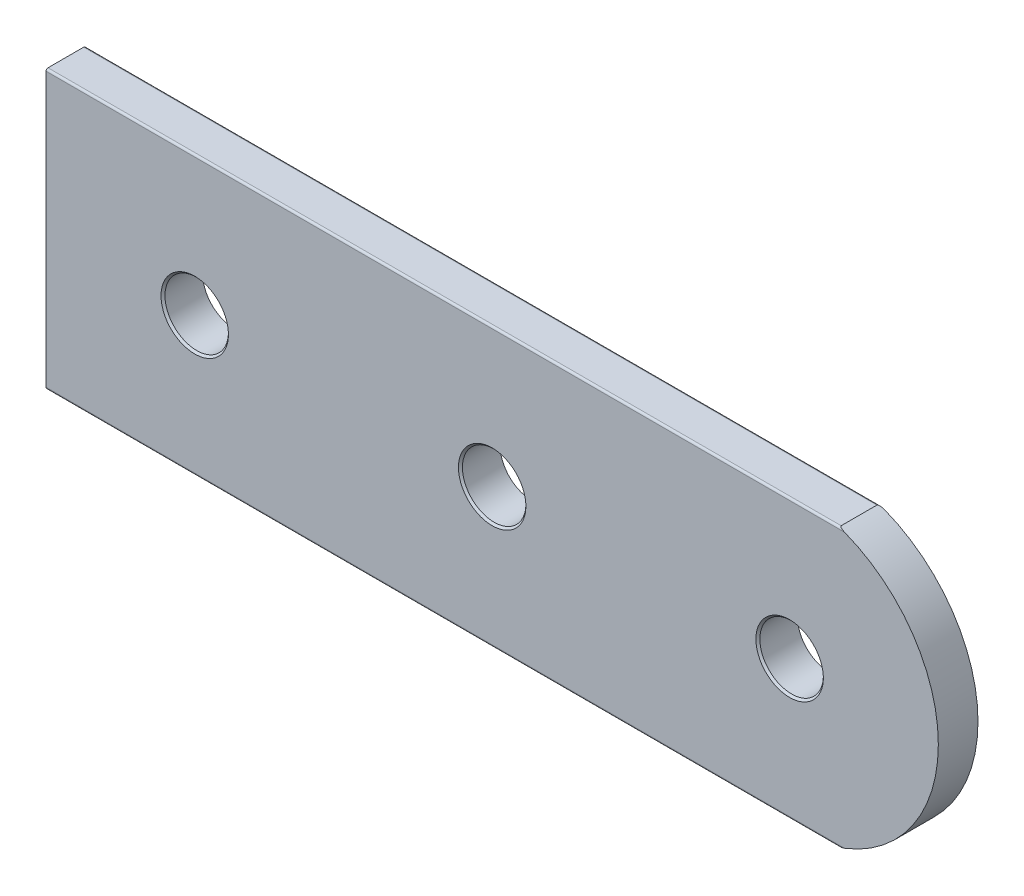
ISO-10303-21;
HEADER;
FILE_DESCRIPTION(('STEP AP214'),'2;1');
FILE_NAME('part.step','',(''),(''),'','','');
FILE_SCHEMA(('AUTOMOTIVE_DESIGN { 1 0 10303 214 1 1 1 1 }'));
ENDSEC;
DATA;
#1=APPLICATION_CONTEXT('core data for automotive mechanical design processes');
#2=APPLICATION_PROTOCOL_DEFINITION('international standard','automotive_design',2000,#1);
#3=PRODUCT_CONTEXT('',#1,'mechanical');
#4=PRODUCT('Part','Part','',(#3));
#5=PRODUCT_RELATED_PRODUCT_CATEGORY('part','',(#4));
#6=PRODUCT_DEFINITION_FORMATION('','',#4);
#7=PRODUCT_DEFINITION_CONTEXT('part definition',#1,'design');
#8=PRODUCT_DEFINITION('design','',#6,#7);
#9=PRODUCT_DEFINITION_SHAPE('','',#8);
#10=(LENGTH_UNIT() NAMED_UNIT(*) SI_UNIT(.MILLI.,.METRE.));
#11=(NAMED_UNIT(*) PLANE_ANGLE_UNIT() SI_UNIT($,.RADIAN.));
#12=(NAMED_UNIT(*) SI_UNIT($,.STERADIAN.) SOLID_ANGLE_UNIT());
#13=UNCERTAINTY_MEASURE_WITH_UNIT(LENGTH_MEASURE(1.E-05),#10,'distance_accuracy_value','');
#14=(GEOMETRIC_REPRESENTATION_CONTEXT(3) GLOBAL_UNCERTAINTY_ASSIGNED_CONTEXT((#13)) GLOBAL_UNIT_ASSIGNED_CONTEXT((#10,
#11,#12)) REPRESENTATION_CONTEXT('',''));
#15=CARTESIAN_POINT('',(0.,0.,0.));
#16=DIRECTION('',(0.,0.,1.));
#17=DIRECTION('',(1.,0.,0.));
#18=AXIS2_PLACEMENT_3D('',#15,#16,#17);
#19=CARTESIAN_POINT('',(35.2,0.,4.));
#20=DIRECTION('',(0.,0.,-1.));
#21=DIRECTION('',(-1.,0.,0.));
#22=AXIS2_PLACEMENT_3D('',#19,#20,#21);
#23=PLANE('',#22);
#24=CARTESIAN_POINT('',(35.,0.,4.));
#25=DIRECTION('',(0.,0.,-1.));
#26=DIRECTION('',(-1.,0.,0.));
#27=AXIS2_PLACEMENT_3D('',#24,#25,#26);
#28=CIRCLE('',#27,3.39999999999997);
#29=CARTESIAN_POINT('',(31.6,0.,4.));
#30=VERTEX_POINT('',#29);
#31=EDGE_CURVE('E236',#30,#30,#28,.T.);
#32=ORIENTED_EDGE('',*,*,#31,.T.);
#33=EDGE_LOOP('',(#32));
#34=FACE_BOUND('',#33,.T.);
#35=CARTESIAN_POINT('',(5.00000000000002,0.,4.));
#36=DIRECTION('',(0.,0.,-1.));
#37=DIRECTION('',(-1.,0.,0.));
#38=AXIS2_PLACEMENT_3D('',#35,#36,#37);
#39=CIRCLE('',#38,3.39999999999997);
#40=CARTESIAN_POINT('',(1.60000000000005,0.,4.));
#41=VERTEX_POINT('',#40);
#42=EDGE_CURVE('E233',#41,#41,#39,.T.);
#43=ORIENTED_EDGE('',*,*,#42,.T.);
#44=EDGE_LOOP('',(#43));
#45=FACE_BOUND('',#44,.T.);
#46=CARTESIAN_POINT('',(-25.,0.,4.));
#47=DIRECTION('',(0.,0.,-1.));
#48=DIRECTION('',(-1.,0.,0.));
#49=AXIS2_PLACEMENT_3D('',#46,#47,#48);
#50=CIRCLE('',#49,3.39999999999997);
#51=CARTESIAN_POINT('',(-28.4,0.,4.));
#52=VERTEX_POINT('',#51);
#53=EDGE_CURVE('E230',#52,#52,#50,.T.);
#54=ORIENTED_EDGE('',*,*,#53,.T.);
#55=EDGE_LOOP('',(#54));
#56=FACE_BOUND('',#55,.T.);
#57=DIRECTION('',(0.,-1.,0.));
#58=VECTOR('',#57,1.);
#59=CARTESIAN_POINT('',(-40.,14.,4.));
#60=LINE('',#59,#58);
#61=CARTESIAN_POINT('',(-40.,13.8,4.));
#62=VERTEX_POINT('',#61);
#63=CARTESIAN_POINT('',(-40.,-13.8,4.));
#64=VERTEX_POINT('',#63);
#65=EDGE_CURVE('E105',#62,#64,#60,.T.);
#66=ORIENTED_EDGE('',*,*,#65,.T.);
#67=DIRECTION('',(1.,0.,0.));
#68=VECTOR('',#67,1.);
#69=CARTESIAN_POINT('',(35.2,-13.8,4.));
#70=LINE('',#69,#68);
#71=CARTESIAN_POINT('',(40.5478967828484,-13.8,4.));
#72=VERTEX_POINT('',#71);
#73=EDGE_CURVE('E203',#64,#72,#70,.T.);
#74=ORIENTED_EDGE('',*,*,#73,.T.);
#75=CARTESIAN_POINT('',(35.2,0.,4.));
#76=DIRECTION('',(0.,0.,1.));
#77=DIRECTION('',(-1.,0.,0.));
#78=AXIS2_PLACEMENT_3D('',#75,#76,#77);
#79=CIRCLE('',#78,14.8);
#80=CARTESIAN_POINT('',(40.5478967828484,13.8,4.));
#81=VERTEX_POINT('',#80);
#82=EDGE_CURVE('E88',#72,#81,#79,.T.);
#83=ORIENTED_EDGE('',*,*,#82,.T.);
#84=DIRECTION('',(-1.,0.,0.));
#85=VECTOR('',#84,1.);
#86=CARTESIAN_POINT('',(35.2,13.8,4.));
#87=LINE('',#86,#85);
#88=EDGE_CURVE('E200',#81,#62,#87,.T.);
#89=ORIENTED_EDGE('',*,*,#88,.T.);
#90=EDGE_LOOP('',(#66,#74,#83,#89));
#91=FACE_BOUND('',#90,.T.);
#92=ADVANCED_FACE('F16',(#34,#45,#56,#91),#23,.F.);
#93=CARTESIAN_POINT('',(35.2,0.,0.));
#94=DIRECTION('',(0.,0.,-1.));
#95=DIRECTION('',(-1.,0.,0.));
#96=AXIS2_PLACEMENT_3D('',#93,#94,#95);
#97=PLANE('',#96);
#98=CARTESIAN_POINT('',(5.00000000000002,0.,0.));
#99=DIRECTION('',(0.,0.,1.));
#100=DIRECTION('',(1.,0.,0.));
#101=AXIS2_PLACEMENT_3D('',#98,#99,#100);
#102=CIRCLE('',#101,3.2);
#103=CARTESIAN_POINT('',(8.20000000000002,0.,0.));
#104=VERTEX_POINT('',#103);
#105=EDGE_CURVE('E276',#104,#104,#102,.T.);
#106=ORIENTED_EDGE('',*,*,#105,.T.);
#107=EDGE_LOOP('',(#106));
#108=FACE_BOUND('',#107,.T.);
#109=CARTESIAN_POINT('',(35.2,0.,0.));
#110=DIRECTION('',(0.,0.,1.));
#111=DIRECTION('',(-1.,0.,0.));
#112=AXIS2_PLACEMENT_3D('',#109,#110,#111);
#113=CIRCLE('',#112,14.8);
#114=CARTESIAN_POINT('',(40.5478967828484,-13.8,0.));
#115=VERTEX_POINT('',#114);
#116=CARTESIAN_POINT('',(40.5478967828484,13.8,0.));
#117=VERTEX_POINT('',#116);
#118=EDGE_CURVE('E195',#115,#117,#113,.T.);
#119=ORIENTED_EDGE('',*,*,#118,.F.);
#120=DIRECTION('',(1.,0.,0.));
#121=VECTOR('',#120,1.);
#122=CARTESIAN_POINT('',(-40.,-13.8,0.));
#123=LINE('',#122,#121);
#124=CARTESIAN_POINT('',(-40.,-13.8,0.));
#125=VERTEX_POINT('',#124);
#126=EDGE_CURVE('E199',#115,#125,#123,.F.);
#127=ORIENTED_EDGE('',*,*,#126,.T.);
#128=DIRECTION('',(0.,-1.,0.));
#129=VECTOR('',#128,1.);
#130=CARTESIAN_POINT('',(-40.,14.,0.));
#131=LINE('',#130,#129);
#132=CARTESIAN_POINT('',(-40.,13.8,0.));
#133=VERTEX_POINT('',#132);
#134=EDGE_CURVE('E191',#133,#125,#131,.T.);
#135=ORIENTED_EDGE('',*,*,#134,.F.);
#136=DIRECTION('',(-1.,0.,0.));
#137=VECTOR('',#136,1.);
#138=CARTESIAN_POINT('',(40.,13.8,0.));
#139=LINE('',#138,#137);
#140=EDGE_CURVE('E389',#133,#117,#139,.F.);
#141=ORIENTED_EDGE('',*,*,#140,.T.);
#142=EDGE_LOOP('',(#119,#127,#135,#141));
#143=FACE_BOUND('',#142,.T.);
#144=CARTESIAN_POINT('',(-25.,0.,0.));
#145=DIRECTION('',(0.,0.,1.));
#146=DIRECTION('',(1.,0.,0.));
#147=AXIS2_PLACEMENT_3D('',#144,#145,#146);
#148=CIRCLE('',#147,3.2);
#149=CARTESIAN_POINT('',(-21.8,0.,0.));
#150=VERTEX_POINT('',#149);
#151=EDGE_CURVE('E224',#150,#150,#148,.T.);
#152=ORIENTED_EDGE('',*,*,#151,.T.);
#153=EDGE_LOOP('',(#152));
#154=FACE_BOUND('',#153,.T.);
#155=CARTESIAN_POINT('',(35.,0.,0.));
#156=DIRECTION('',(0.,0.,1.));
#157=DIRECTION('',(1.,0.,0.));
#158=AXIS2_PLACEMENT_3D('',#155,#156,#157);
#159=CIRCLE('',#158,3.2);
#160=CARTESIAN_POINT('',(38.2,0.,0.));
#161=VERTEX_POINT('',#160);
#162=EDGE_CURVE('E278',#161,#161,#159,.T.);
#163=ORIENTED_EDGE('',*,*,#162,.T.);
#164=EDGE_LOOP('',(#163));
#165=FACE_BOUND('',#164,.T.);
#166=ADVANCED_FACE('F134',(#108,#143,#154,#165),#97,.T.);
#167=CARTESIAN_POINT('',(35.2,0.,4.));
#168=DIRECTION('',(0.,0.,-1.));
#169=DIRECTION('',(-1.,0.,0.));
#170=AXIS2_PLACEMENT_3D('',#167,#168,#169);
#171=CYLINDRICAL_SURFACE('',#170,14.8);
#172=DIRECTION('',(0.,0.,-1.));
#173=VECTOR('',#172,1.);
#174=CARTESIAN_POINT('',(40.,-14.,4.));
#175=LINE('',#174,#173);
#176=CARTESIAN_POINT('',(40.,-14.,3.8));
#177=VERTEX_POINT('',#176);
#178=CARTESIAN_POINT('',(40.,-14.,0.2));
#179=VERTEX_POINT('',#178);
#180=EDGE_CURVE('E86',#177,#179,#175,.T.);
#181=ORIENTED_EDGE('',*,*,#180,.T.);
#182=CARTESIAN_POINT('',(40.,-14.,0.2));
#183=CARTESIAN_POINT('',(39.999987042076,-14.0000043871712,0.195760955519449));
#184=CARTESIAN_POINT('',(40.0003924547076,-13.9998654476036,0.191541560953724));
#185=CARTESIAN_POINT('',(40.0019157839262,-13.9993430498048,0.183307048887309));
#186=CARTESIAN_POINT('',(40.003023711759,-13.9989630194992,0.179289906369511));
#187=CARTESIAN_POINT('',(40.0061923361807,-13.9978754982801,0.170507511967823));
#188=CARTESIAN_POINT('',(40.0084239940115,-13.9971091997623,0.165812868750464));
#189=CARTESIAN_POINT('',(40.0135669859811,-13.995341382195,0.156840239871947));
#190=CARTESIAN_POINT('',(40.0164822022964,-13.994338519408,0.152564839655963));
#191=CARTESIAN_POINT('',(40.0251031983457,-13.9913691997737,0.141418611532193));
#192=CARTESIAN_POINT('',(40.0312802539167,-13.9892379520293,0.134961923501008));
#193=CARTESIAN_POINT('',(40.0443997520876,-13.984700212358,0.123016076352729));
#194=CARTESIAN_POINT('',(40.0513439063475,-13.9822931044258,0.117529154992094));
#195=CARTESIAN_POINT('',(40.0688416352545,-13.9762119296496,0.105043193371178));
#196=CARTESIAN_POINT('',(40.0796412237347,-13.9724456488635,0.0984380932553144));
#197=CARTESIAN_POINT('',(40.1017669496461,-13.9646990540494,0.0863098527561242));
#198=CARTESIAN_POINT('',(40.1130941551654,-13.9607183030571,0.0807890366032843));
#199=CARTESIAN_POINT('',(40.1477449128963,-13.9484917086814,0.0653704033831685));
#200=CARTESIAN_POINT('',(40.1715482278738,-13.9400272196656,0.0567343469871422));
#201=CARTESIAN_POINT('',(40.2250540222698,-13.9208409895013,0.0400272394068397));
#202=CARTESIAN_POINT('',(40.2548896714128,-13.910036370565,0.0325103618960423));
#203=CARTESIAN_POINT('',(40.3149985693746,-13.8880458146632,0.0199792859557485));
#204=CARTESIAN_POINT('',(40.3452725555086,-13.8768591779079,0.014969976216418));
#205=CARTESIAN_POINT('',(40.404323771512,-13.8548169174474,0.00732406290818679));
#206=CARTESIAN_POINT('',(40.4330922660666,-13.8439766712403,0.00457263510048292));
#207=CARTESIAN_POINT('',(40.4905521292495,-13.8221200651228,0.000926105912625353));
#208=CARTESIAN_POINT('',(40.5192433617528,-13.81110455578,2.38148476812331E-05));
#209=CARTESIAN_POINT('',(40.5478967828484,-13.8,0.));
#210=B_SPLINE_CURVE_WITH_KNOTS('',3,(#182,#183,#184,#185,#186,#187,#188,#189,#190,#191,#192,
#193,#194,#195,#196,#197,#198,#199,#200,#201,#202,#203,#204,#205,#206,#207,#208,#209),
.UNSPECIFIED.,.F.,.F.,(4,2,2,2,2,2,2,2,2,2,2,2,2,4),(0.,0.0126639868598921,0.0251518284803406,
0.0408256232179408,0.0565906886375604,0.0839945909873167,0.11146092547406,0.150987600963404,
0.19059810113327,0.270510111264701,0.368219237782434,0.466118120769147,0.558660565763093,
0.650842505716824),.UNSPECIFIED.);
#211=EDGE_CURVE('E93',#179,#115,#210,.T.);
#212=ORIENTED_EDGE('',*,*,#211,.T.);
#213=ORIENTED_EDGE('',*,*,#118,.T.);
#214=CARTESIAN_POINT('',(40.5478967828484,13.8,0.));
#215=CARTESIAN_POINT('',(40.5165311801748,13.8121559696248,3.60995158997288E-05));
#216=CARTESIAN_POINT('',(40.4851138393947,13.8242072440809,0.00111113933739787));
#217=CARTESIAN_POINT('',(40.4221646198644,13.8481092353699,0.00548019975328445));
#218=CARTESIAN_POINT('',(40.3906330337099,13.8599585251929,0.00878612195310392));
#219=CARTESIAN_POINT('',(40.3277160350305,13.883359093863,0.017770366566271));
#220=CARTESIAN_POINT('',(40.2963310952751,13.8949096614879,0.0234538804574722));
#221=CARTESIAN_POINT('',(40.2340932349799,13.9175785933099,0.0376527320327874));
#222=CARTESIAN_POINT('',(40.2032391884111,13.9286979579835,0.046161014488099));
#223=CARTESIAN_POINT('',(40.1615972136583,13.9435540758245,0.0606320321169265));
#224=CARTESIAN_POINT('',(40.1503067883027,13.9475662265758,0.0648681074503328));
#225=CARTESIAN_POINT('',(40.1279390036785,13.9554848623507,0.0740571155682161));
#226=CARTESIAN_POINT('',(40.1168622849338,13.9593910407608,0.0790119096506931));
#227=CARTESIAN_POINT('',(40.0937859736942,13.9674989167505,0.0904590800527942));
#228=CARTESIAN_POINT('',(40.0818347904806,13.9716799573605,0.0970645465211912));
#229=CARTESIAN_POINT('',(40.0588079055135,13.9797042641025,0.111809526536523));
#230=CARTESIAN_POINT('',(40.0477281825416,13.9835490921079,0.119941326041668));
#231=CARTESIAN_POINT('',(40.0335740551193,13.9884445324383,0.132891394582925));
#232=CARTESIAN_POINT('',(40.0297146590694,13.9897773890004,0.136734561549714));
#233=CARTESIAN_POINT('',(40.0224101871849,13.9922969792871,0.144862828623583));
#234=CARTESIAN_POINT('',(40.0189659358881,13.9934834223209,0.149148777813661));
#235=CARTESIAN_POINT('',(40.0126431112382,13.9956592434839,0.158287771951593));
#236=CARTESIAN_POINT('',(40.0097749679003,13.9966449918745,0.163149106174707));
#237=CARTESIAN_POINT('',(40.0050018875548,13.9982842993935,0.173361829232966));
#238=CARTESIAN_POINT('',(40.0030905257107,13.9989400744688,0.178709656300648));
#239=CARTESIAN_POINT('',(40.0012243613107,13.9995801732649,0.186791460763203));
#240=CARTESIAN_POINT('',(40.0007696924647,13.9997360878911,0.189400014934447));
#241=CARTESIAN_POINT('',(40.000155673969,13.9999466265476,0.194671122637961));
#242=CARTESIAN_POINT('',(39.9999980944716,14.0000006434399,0.197333904880659));
#243=CARTESIAN_POINT('',(39.9999999999996,14.0000000000002,0.199999999999877));
#244=B_SPLINE_CURVE_WITH_KNOTS('',3,(#214,#215,#216,#217,#218,#219,#220,#221,#222,#223,#224,
#225,#226,#227,#228,#229,#230,#231,#232,#233,#234,#235,#236,#237,#238,#239,#240,#241,#242,#243),
.UNSPECIFIED.,.F.,.F.,(4,2,2,2,2,2,2,2,2,2,2,2,2,2,4),(0.,0.100918319315302,0.202379332552382,
0.304063052171365,0.405494690385964,0.44360584994196,0.481817530662832,0.524606883458227,
0.567185535076796,0.583982284780748,0.600811863961887,0.617923056422423,0.634917751013695,
0.642857873811067,0.650845158661821),.UNSPECIFIED.);
#245=CARTESIAN_POINT('',(40.,14.,0.2));
#246=VERTEX_POINT('',#245);
#247=EDGE_CURVE('E94',#117,#246,#244,.T.);
#248=ORIENTED_EDGE('',*,*,#247,.T.);
#249=DIRECTION('',(0.,0.,-1.));
#250=VECTOR('',#249,1.);
#251=CARTESIAN_POINT('',(40.,14.,4.));
#252=LINE('',#251,#250);
#253=CARTESIAN_POINT('',(40.,14.,3.8));
#254=VERTEX_POINT('',#253);
#255=EDGE_CURVE('E211',#254,#246,#252,.T.);
#256=ORIENTED_EDGE('',*,*,#255,.F.);
#257=CARTESIAN_POINT('',(40.,14.,3.8));
#258=CARTESIAN_POINT('',(39.9999870420761,14.0000043871712,3.80423904448055));
#259=CARTESIAN_POINT('',(40.0003924547076,13.9998654476036,3.80845843904628));
#260=CARTESIAN_POINT('',(40.0019157839262,13.9993430498048,3.81669295111269));
#261=CARTESIAN_POINT('',(40.003023711759,13.9989630194992,3.82071009363049));
#262=CARTESIAN_POINT('',(40.0061923361807,13.9978754982801,3.82949248803218));
#263=CARTESIAN_POINT('',(40.0084239940115,13.9971091997623,3.83418713124953));
#264=CARTESIAN_POINT('',(40.0135669859811,13.995341382195,3.84315976012805));
#265=CARTESIAN_POINT('',(40.0164822022964,13.994338519408,3.84743516034404));
#266=CARTESIAN_POINT('',(40.0251031983457,13.9913691997737,3.85858138846781));
#267=CARTESIAN_POINT('',(40.0312802539167,13.9892379520293,3.86503807649899));
#268=CARTESIAN_POINT('',(40.0443997520876,13.984700212358,3.87698392364727));
#269=CARTESIAN_POINT('',(40.0513439063475,13.9822931044258,3.88247084500791));
#270=CARTESIAN_POINT('',(40.0688416352545,13.9762119296496,3.89495680662883));
#271=CARTESIAN_POINT('',(40.0796412237347,13.9724456488635,3.90156190674469));
#272=CARTESIAN_POINT('',(40.1017669496461,13.9646990540494,3.91369014724388));
#273=CARTESIAN_POINT('',(40.1130941551654,13.9607183030571,3.91921096339672));
#274=CARTESIAN_POINT('',(40.1477449128963,13.9484917086814,3.93462959661684));
#275=CARTESIAN_POINT('',(40.1715482278738,13.9400272196656,3.94326565301286));
#276=CARTESIAN_POINT('',(40.2250540222698,13.9208409895013,3.95997276059316));
#277=CARTESIAN_POINT('',(40.2548896714128,13.910036370565,3.96748963810396));
#278=CARTESIAN_POINT('',(40.3149985693746,13.8880458146632,3.98002071404426));
#279=CARTESIAN_POINT('',(40.3452725555086,13.8768591779079,3.98503002378359));
#280=CARTESIAN_POINT('',(40.404323771512,13.8548169174474,3.99267593709182));
#281=CARTESIAN_POINT('',(40.4330922660667,13.8439766712403,3.99542736489952));
#282=CARTESIAN_POINT('',(40.4905521292495,13.8221200651228,3.99907389408737));
#283=CARTESIAN_POINT('',(40.5192433617528,13.81110455578,3.99997618515232));
#284=CARTESIAN_POINT('',(40.5478967828484,13.8,4.));
#285=B_SPLINE_CURVE_WITH_KNOTS('',3,(#257,#258,#259,#260,#261,#262,#263,#264,#265,#266,#267,
#268,#269,#270,#271,#272,#273,#274,#275,#276,#277,#278,#279,#280,#281,#282,#283,#284),
.UNSPECIFIED.,.F.,.F.,(4,2,2,2,2,2,2,2,2,2,2,2,2,4),(0.,0.0126639868598926,0.0251518284803369,
0.040825623217938,0.0565906886375565,0.0839945909873197,0.111460925474059,0.150987600963408,
0.190598101133273,0.270510111264712,0.368219237782459,0.466118120769173,0.558660565763111,
0.650842505716819),.UNSPECIFIED.);
#286=EDGE_CURVE('E112',#254,#81,#285,.T.);
#287=ORIENTED_EDGE('',*,*,#286,.T.);
#288=ORIENTED_EDGE('',*,*,#82,.F.);
#289=CARTESIAN_POINT('',(40.5478967828484,-13.8,4.));
#290=CARTESIAN_POINT('',(40.5165311801748,-13.8121559696248,3.9999639004841));
#291=CARTESIAN_POINT('',(40.4851138393947,-13.8242072440809,3.9988888606626));
#292=CARTESIAN_POINT('',(40.4221646198644,-13.8481092353699,3.99451980024671));
#293=CARTESIAN_POINT('',(40.3906330337099,-13.8599585251929,3.9912138780469));
#294=CARTESIAN_POINT('',(40.3277160350305,-13.8833590938631,3.98222963343373));
#295=CARTESIAN_POINT('',(40.2963310952751,-13.8949096614879,3.97654611954253));
#296=CARTESIAN_POINT('',(40.2340932349799,-13.9175785933099,3.96234726796721));
#297=CARTESIAN_POINT('',(40.2032391884111,-13.9286979579835,3.9538389855119));
#298=CARTESIAN_POINT('',(40.1615972136583,-13.9435540758245,3.93936796788307));
#299=CARTESIAN_POINT('',(40.1503067883027,-13.9475662265758,3.93513189254966));
#300=CARTESIAN_POINT('',(40.1279390036785,-13.9554848623507,3.92594288443178));
#301=CARTESIAN_POINT('',(40.1168622849338,-13.9593910407608,3.92098809034931));
#302=CARTESIAN_POINT('',(40.0937859736942,-13.9674989167505,3.90954091994721));
#303=CARTESIAN_POINT('',(40.0818347904806,-13.9716799573605,3.90293545347881));
#304=CARTESIAN_POINT('',(40.0588079055135,-13.9797042641025,3.88819047346349));
#305=CARTESIAN_POINT('',(40.0477281825416,-13.9835490921079,3.88005867395834));
#306=CARTESIAN_POINT('',(40.0335740551193,-13.9884445324383,3.86710860541709));
#307=CARTESIAN_POINT('',(40.0297146590694,-13.9897773890004,3.8632654384503));
#308=CARTESIAN_POINT('',(40.0224101871849,-13.9922969792871,3.85513717137643));
#309=CARTESIAN_POINT('',(40.0189659358881,-13.9934834223209,3.85085122218635));
#310=CARTESIAN_POINT('',(40.0126431112382,-13.9956592434839,3.84171222804842));
#311=CARTESIAN_POINT('',(40.0097749679003,-13.9966449918745,3.8368508938253));
#312=CARTESIAN_POINT('',(40.0050018875548,-13.9982842993935,3.82663817076704));
#313=CARTESIAN_POINT('',(40.0030905257107,-13.9989400744688,3.82129034369936));
#314=CARTESIAN_POINT('',(40.0012243613107,-13.9995801732649,3.8132085392368));
#315=CARTESIAN_POINT('',(40.0007696924647,-13.9997360878911,3.81059998506556));
#316=CARTESIAN_POINT('',(40.000155673969,-13.9999466265476,3.80532887736204));
#317=CARTESIAN_POINT('',(39.9999980944715,-14.0000006434399,3.80266609511934));
#318=CARTESIAN_POINT('',(39.9999999999995,-14.0000000000002,3.80000000000012));
#319=B_SPLINE_CURVE_WITH_KNOTS('',3,(#289,#290,#291,#292,#293,#294,#295,#296,#297,#298,#299,
#300,#301,#302,#303,#304,#305,#306,#307,#308,#309,#310,#311,#312,#313,#314,#315,#316,#317,#318),
.UNSPECIFIED.,.F.,.F.,(4,2,2,2,2,2,2,2,2,2,2,2,2,2,4),(0.,0.100918319315309,0.202379332552383,
0.304063052171364,0.405494690385971,0.443605849941969,0.481817530662819,0.52460688345821,
0.567185535076776,0.583982284780736,0.600811863961875,0.617923056422417,0.63491775101369,
0.642857873811064,0.650845158661822),.UNSPECIFIED.);
#320=EDGE_CURVE('E83',#72,#177,#319,.T.);
#321=ORIENTED_EDGE('',*,*,#320,.T.);
#322=EDGE_LOOP('',(#181,#212,#213,#248,#256,#287,#288,#321));
#323=FACE_BOUND('',#322,.T.);
#324=ADVANCED_FACE('F85',(#323),#171,.T.);
#325=CARTESIAN_POINT('',(-40.,14.,4.));
#326=DIRECTION('',(0.,-1.,0.));
#327=DIRECTION('',(1.,0.,0.));
#328=AXIS2_PLACEMENT_3D('',#325,#326,#327);
#329=PLANE('',#328);
#330=ORIENTED_EDGE('',*,*,#255,.T.);
#331=DIRECTION('',(-1.,0.,0.));
#332=VECTOR('',#331,1.);
#333=CARTESIAN_POINT('',(-40.,14.,0.2));
#334=LINE('',#333,#332);
#335=CARTESIAN_POINT('',(-40.,14.,0.2));
#336=VERTEX_POINT('',#335);
#337=EDGE_CURVE('E10',#246,#336,#334,.T.);
#338=ORIENTED_EDGE('',*,*,#337,.T.);
#339=DIRECTION('',(0.,0.,-1.));
#340=VECTOR('',#339,1.);
#341=CARTESIAN_POINT('',(-40.,14.,4.));
#342=LINE('',#341,#340);
#343=CARTESIAN_POINT('',(-40.,14.,3.8));
#344=VERTEX_POINT('',#343);
#345=EDGE_CURVE('E212',#344,#336,#342,.T.);
#346=ORIENTED_EDGE('',*,*,#345,.F.);
#347=DIRECTION('',(-1.,0.,0.));
#348=VECTOR('',#347,1.);
#349=CARTESIAN_POINT('',(-40.,14.,3.8));
#350=LINE('',#349,#348);
#351=EDGE_CURVE('E25',#344,#254,#350,.F.);
#352=ORIENTED_EDGE('',*,*,#351,.T.);
#353=EDGE_LOOP('',(#330,#338,#346,#352));
#354=FACE_BOUND('',#353,.T.);
#355=ADVANCED_FACE('F133',(#354),#329,.F.);
#356=CARTESIAN_POINT('',(-40.,14.,4.));
#357=DIRECTION('',(1.,0.,0.));
#358=DIRECTION('',(0.,1.,0.));
#359=AXIS2_PLACEMENT_3D('',#356,#357,#358);
#360=PLANE('',#359);
#361=ORIENTED_EDGE('',*,*,#134,.T.);
#362=CARTESIAN_POINT('',(-40.,-13.8,0.2));
#363=DIRECTION('',(1.,0.,0.));
#364=DIRECTION('',(0.,1.,0.));
#365=AXIS2_PLACEMENT_3D('',#362,#363,#364);
#366=CIRCLE('',#365,0.2);
#367=CARTESIAN_POINT('',(-40.,-14.,0.2));
#368=VERTEX_POINT('',#367);
#369=EDGE_CURVE('E193',#125,#368,#366,.F.);
#370=ORIENTED_EDGE('',*,*,#369,.T.);
#371=DIRECTION('',(0.,0.,-1.));
#372=VECTOR('',#371,1.);
#373=CARTESIAN_POINT('',(-40.,-14.,4.));
#374=LINE('',#373,#372);
#375=CARTESIAN_POINT('',(-40.,-14.,3.8));
#376=VERTEX_POINT('',#375);
#377=EDGE_CURVE('E104',#376,#368,#374,.T.);
#378=ORIENTED_EDGE('',*,*,#377,.F.);
#379=CARTESIAN_POINT('',(-40.,-13.8,3.8));
#380=DIRECTION('',(1.,0.,0.));
#381=DIRECTION('',(0.,1.,0.));
#382=AXIS2_PLACEMENT_3D('',#379,#380,#381);
#383=CIRCLE('',#382,0.2);
#384=EDGE_CURVE('E109',#376,#64,#383,.F.);
#385=ORIENTED_EDGE('',*,*,#384,.T.);
#386=ORIENTED_EDGE('',*,*,#65,.F.);
#387=CARTESIAN_POINT('',(-40.,13.8,3.8));
#388=DIRECTION('',(1.,0.,0.));
#389=DIRECTION('',(0.,1.,0.));
#390=AXIS2_PLACEMENT_3D('',#387,#388,#389);
#391=CIRCLE('',#390,0.2);
#392=EDGE_CURVE('E39',#62,#344,#391,.F.);
#393=ORIENTED_EDGE('',*,*,#392,.T.);
#394=ORIENTED_EDGE('',*,*,#345,.T.);
#395=CARTESIAN_POINT('',(-40.,13.8,0.2));
#396=DIRECTION('',(1.,0.,0.));
#397=DIRECTION('',(0.,1.,0.));
#398=AXIS2_PLACEMENT_3D('',#395,#396,#397);
#399=CIRCLE('',#398,0.2);
#400=EDGE_CURVE('E32',#336,#133,#399,.F.);
#401=ORIENTED_EDGE('',*,*,#400,.T.);
#402=EDGE_LOOP('',(#361,#370,#378,#385,#386,#393,#394,#401));
#403=FACE_BOUND('',#402,.T.);
#404=ADVANCED_FACE('F183',(#403),#360,.F.);
#405=CARTESIAN_POINT('',(-40.,-14.,4.));
#406=DIRECTION('',(0.,1.,0.));
#407=DIRECTION('',(-1.,0.,0.));
#408=AXIS2_PLACEMENT_3D('',#405,#406,#407);
#409=PLANE('',#408);
#410=ORIENTED_EDGE('',*,*,#377,.T.);
#411=DIRECTION('',(1.,0.,0.));
#412=VECTOR('',#411,1.);
#413=CARTESIAN_POINT('',(40.,-14.,0.2));
#414=LINE('',#413,#412);
#415=EDGE_CURVE('E103',#368,#179,#414,.T.);
#416=ORIENTED_EDGE('',*,*,#415,.T.);
#417=ORIENTED_EDGE('',*,*,#180,.F.);
#418=DIRECTION('',(1.,0.,0.));
#419=VECTOR('',#418,1.);
#420=CARTESIAN_POINT('',(-40.,-14.,3.8));
#421=LINE('',#420,#419);
#422=EDGE_CURVE('E100',#177,#376,#421,.F.);
#423=ORIENTED_EDGE('',*,*,#422,.T.);
#424=EDGE_LOOP('',(#410,#416,#417,#423));
#425=FACE_BOUND('',#424,.T.);
#426=ADVANCED_FACE('F99',(#425),#409,.F.);
#427=CARTESIAN_POINT('',(-25.,0.,4.));
#428=DIRECTION('',(0.,0.,-1.));
#429=DIRECTION('',(-1.,0.,0.));
#430=AXIS2_PLACEMENT_3D('',#427,#428,#429);
#431=CYLINDRICAL_SURFACE('',#430,3.2);
#432=CARTESIAN_POINT('',(-25.,0.,3.80000000000003));
#433=DIRECTION('',(0.,0.,-1.));
#434=DIRECTION('',(-1.,0.,0.));
#435=AXIS2_PLACEMENT_3D('',#432,#433,#434);
#436=CIRCLE('',#435,3.2);
#437=CARTESIAN_POINT('',(-28.2,0.,3.80000000000003));
#438=VERTEX_POINT('',#437);
#439=EDGE_CURVE('E110',#438,#438,#436,.F.);
#440=ORIENTED_EDGE('',*,*,#439,.T.);
#441=EDGE_LOOP('',(#440));
#442=FACE_BOUND('',#441,.T.);
#443=ORIENTED_EDGE('',*,*,#151,.F.);
#444=EDGE_LOOP('',(#443));
#445=FACE_BOUND('',#444,.T.);
#446=ADVANCED_FACE('F179',(#442,#445),#431,.F.);
#447=CARTESIAN_POINT('',(5.00000000000002,0.,4.));
#448=DIRECTION('',(0.,0.,-1.));
#449=DIRECTION('',(-1.,0.,0.));
#450=AXIS2_PLACEMENT_3D('',#447,#448,#449);
#451=CYLINDRICAL_SURFACE('',#450,3.2);
#452=CARTESIAN_POINT('',(5.00000000000002,0.,3.80000000000002));
#453=DIRECTION('',(0.,0.,-1.));
#454=DIRECTION('',(-1.,0.,0.));
#455=AXIS2_PLACEMENT_3D('',#452,#453,#454);
#456=CIRCLE('',#455,3.2);
#457=CARTESIAN_POINT('',(1.80000000000002,0.,3.80000000000002));
#458=VERTEX_POINT('',#457);
#459=EDGE_CURVE('E115',#458,#458,#456,.F.);
#460=ORIENTED_EDGE('',*,*,#459,.T.);
#461=EDGE_LOOP('',(#460));
#462=FACE_BOUND('',#461,.T.);
#463=ORIENTED_EDGE('',*,*,#105,.F.);
#464=EDGE_LOOP('',(#463));
#465=FACE_BOUND('',#464,.T.);
#466=ADVANCED_FACE('F240',(#462,#465),#451,.F.);
#467=CARTESIAN_POINT('',(35.,0.,4.));
#468=DIRECTION('',(0.,0.,-1.));
#469=DIRECTION('',(-1.,0.,0.));
#470=AXIS2_PLACEMENT_3D('',#467,#468,#469);
#471=CYLINDRICAL_SURFACE('',#470,3.2);
#472=CARTESIAN_POINT('',(35.,0.,3.80000000000003));
#473=DIRECTION('',(0.,0.,-1.));
#474=DIRECTION('',(-1.,0.,0.));
#475=AXIS2_PLACEMENT_3D('',#472,#473,#474);
#476=CIRCLE('',#475,3.2);
#477=CARTESIAN_POINT('',(31.8,0.,3.80000000000003));
#478=VERTEX_POINT('',#477);
#479=EDGE_CURVE('E215',#478,#478,#476,.F.);
#480=ORIENTED_EDGE('',*,*,#479,.T.);
#481=EDGE_LOOP('',(#480));
#482=FACE_BOUND('',#481,.T.);
#483=ORIENTED_EDGE('',*,*,#162,.F.);
#484=EDGE_LOOP('',(#483));
#485=FACE_BOUND('',#484,.T.);
#486=ADVANCED_FACE('F252',(#482,#485),#471,.F.);
#487=CARTESIAN_POINT('',(35.,0.,3.80000000000003));
#488=DIRECTION('',(0.,0.,1.));
#489=DIRECTION('',(1.,0.,0.));
#490=AXIS2_PLACEMENT_3D('',#487,#488,#489);
#491=CONICAL_SURFACE('',#490,3.2,0.785398163397441);
#492=ORIENTED_EDGE('',*,*,#31,.F.);
#493=EDGE_LOOP('',(#492));
#494=FACE_BOUND('',#493,.T.);
#495=ORIENTED_EDGE('',*,*,#479,.F.);
#496=EDGE_LOOP('',(#495));
#497=FACE_BOUND('',#496,.T.);
#498=ADVANCED_FACE('F137',(#494,#497),#491,.F.);
#499=CARTESIAN_POINT('',(5.00000000000002,0.,3.80000000000002));
#500=DIRECTION('',(0.,0.,1.));
#501=DIRECTION('',(1.,0.,0.));
#502=AXIS2_PLACEMENT_3D('',#499,#500,#501);
#503=CONICAL_SURFACE('',#502,3.2,0.785398163397441);
#504=ORIENTED_EDGE('',*,*,#42,.F.);
#505=EDGE_LOOP('',(#504));
#506=FACE_BOUND('',#505,.T.);
#507=ORIENTED_EDGE('',*,*,#459,.F.);
#508=EDGE_LOOP('',(#507));
#509=FACE_BOUND('',#508,.T.);
#510=ADVANCED_FACE('F243',(#506,#509),#503,.F.);
#511=CARTESIAN_POINT('',(-25.,0.,3.80000000000003));
#512=DIRECTION('',(0.,0.,1.));
#513=DIRECTION('',(1.,0.,0.));
#514=AXIS2_PLACEMENT_3D('',#511,#512,#513);
#515=CONICAL_SURFACE('',#514,3.2,0.785398163397441);
#516=ORIENTED_EDGE('',*,*,#53,.F.);
#517=EDGE_LOOP('',(#516));
#518=FACE_BOUND('',#517,.T.);
#519=ORIENTED_EDGE('',*,*,#439,.F.);
#520=EDGE_LOOP('',(#519));
#521=FACE_BOUND('',#520,.T.);
#522=ADVANCED_FACE('F245',(#518,#521),#515,.F.);
#523=CARTESIAN_POINT('',(-40.,-13.8,0.2));
#524=DIRECTION('',(-1.,0.,0.));
#525=DIRECTION('',(0.,-1.,0.));
#526=AXIS2_PLACEMENT_3D('',#523,#524,#525);
#527=CYLINDRICAL_SURFACE('',#526,0.2);
#528=ORIENTED_EDGE('',*,*,#369,.F.);
#529=ORIENTED_EDGE('',*,*,#126,.F.);
#530=ORIENTED_EDGE('',*,*,#211,.F.);
#531=ORIENTED_EDGE('',*,*,#415,.F.);
#532=EDGE_LOOP('',(#528,#529,#530,#531));
#533=FACE_BOUND('',#532,.T.);
#534=ADVANCED_FACE('F157',(#533),#527,.T.);
#535=CARTESIAN_POINT('',(35.2,-13.8,3.8));
#536=DIRECTION('',(1.,0.,0.));
#537=DIRECTION('',(0.,1.,0.));
#538=AXIS2_PLACEMENT_3D('',#535,#536,#537);
#539=CYLINDRICAL_SURFACE('',#538,0.2);
#540=ORIENTED_EDGE('',*,*,#384,.F.);
#541=ORIENTED_EDGE('',*,*,#422,.F.);
#542=ORIENTED_EDGE('',*,*,#320,.F.);
#543=ORIENTED_EDGE('',*,*,#73,.F.);
#544=EDGE_LOOP('',(#540,#541,#542,#543));
#545=FACE_BOUND('',#544,.T.);
#546=ADVANCED_FACE('F108',(#545),#539,.T.);
#547=CARTESIAN_POINT('',(-40.,13.8,0.2));
#548=DIRECTION('',(1.,0.,0.));
#549=DIRECTION('',(0.,1.,0.));
#550=AXIS2_PLACEMENT_3D('',#547,#548,#549);
#551=CYLINDRICAL_SURFACE('',#550,0.2);
#552=ORIENTED_EDGE('',*,*,#247,.F.);
#553=ORIENTED_EDGE('',*,*,#140,.F.);
#554=ORIENTED_EDGE('',*,*,#400,.F.);
#555=ORIENTED_EDGE('',*,*,#337,.F.);
#556=EDGE_LOOP('',(#552,#553,#554,#555));
#557=FACE_BOUND('',#556,.T.);
#558=ADVANCED_FACE('F156',(#557),#551,.T.);
#559=CARTESIAN_POINT('',(35.2,13.8,3.8));
#560=DIRECTION('',(-1.,0.,0.));
#561=DIRECTION('',(0.,-1.,0.));
#562=AXIS2_PLACEMENT_3D('',#559,#560,#561);
#563=CYLINDRICAL_SURFACE('',#562,0.2);
#564=ORIENTED_EDGE('',*,*,#286,.F.);
#565=ORIENTED_EDGE('',*,*,#351,.F.);
#566=ORIENTED_EDGE('',*,*,#392,.F.);
#567=ORIENTED_EDGE('',*,*,#88,.F.);
#568=EDGE_LOOP('',(#564,#565,#566,#567));
#569=FACE_BOUND('',#568,.T.);
#570=ADVANCED_FACE('F18',(#569),#563,.T.);
#571=CLOSED_SHELL('',(#92,#166,#324,#355,#404,#426,#446,#466,#486,#498,#510,#522,#534,#546,#558,#570));
#572=MANIFOLD_SOLID_BREP('B1',#571);
#573=ADVANCED_BREP_SHAPE_REPRESENTATION('',(#18,#572),#14);
#574=SHAPE_DEFINITION_REPRESENTATION(#9,#573);
ENDSEC;
END-ISO-10303-21;
